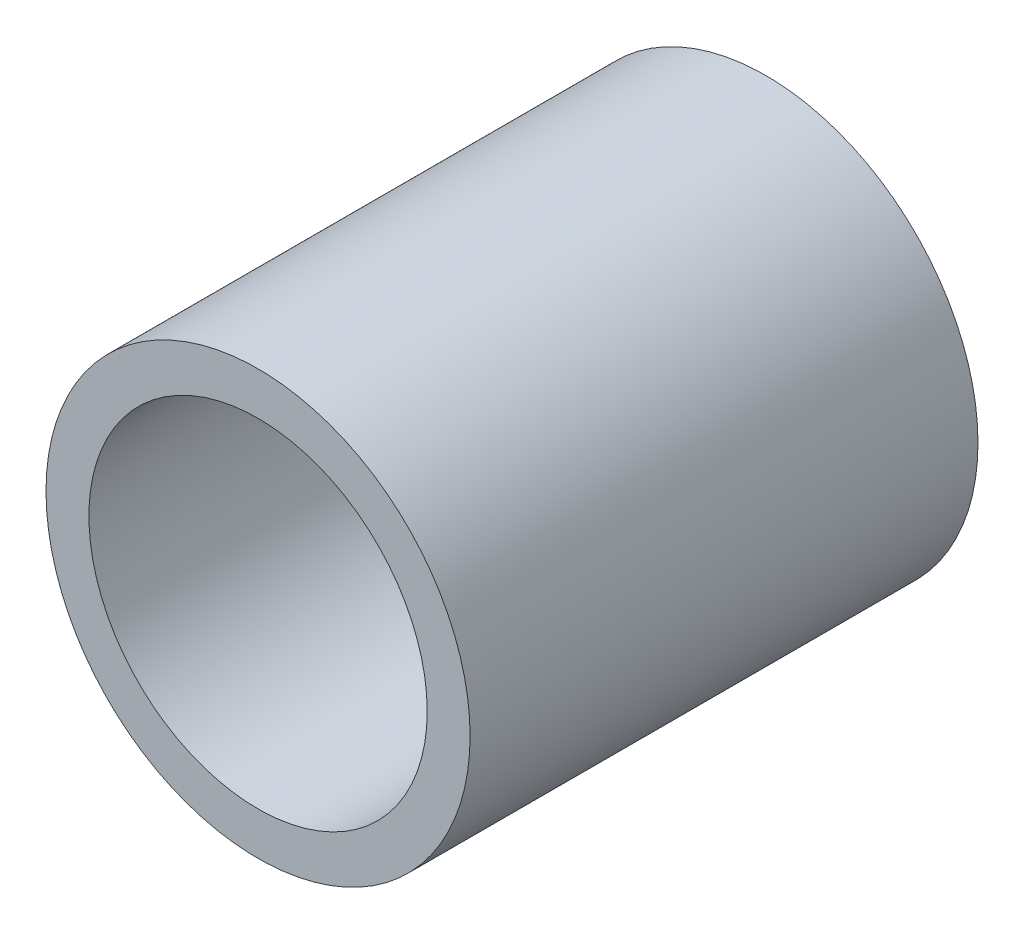
ISO-10303-21;
HEADER;
FILE_DESCRIPTION(('STEP AP214'),'2;1');
FILE_NAME('part.step','',(''),(''),'','','');
FILE_SCHEMA(('AUTOMOTIVE_DESIGN { 1 0 10303 214 1 1 1 1 }'));
ENDSEC;
DATA;
#1=APPLICATION_CONTEXT('core data for automotive mechanical design processes');
#2=APPLICATION_PROTOCOL_DEFINITION('international standard','automotive_design',2000,#1);
#3=PRODUCT_CONTEXT('',#1,'mechanical');
#4=PRODUCT('Part','Part','',(#3));
#5=PRODUCT_RELATED_PRODUCT_CATEGORY('part','',(#4));
#6=PRODUCT_DEFINITION_FORMATION('','',#4);
#7=PRODUCT_DEFINITION_CONTEXT('part definition',#1,'design');
#8=PRODUCT_DEFINITION('design','',#6,#7);
#9=PRODUCT_DEFINITION_SHAPE('','',#8);
#10=(LENGTH_UNIT() NAMED_UNIT(*) SI_UNIT(.MILLI.,.METRE.));
#11=(NAMED_UNIT(*) PLANE_ANGLE_UNIT() SI_UNIT($,.RADIAN.));
#12=(NAMED_UNIT(*) SI_UNIT($,.STERADIAN.) SOLID_ANGLE_UNIT());
#13=UNCERTAINTY_MEASURE_WITH_UNIT(LENGTH_MEASURE(1.E-05),#10,'distance_accuracy_value','');
#14=(GEOMETRIC_REPRESENTATION_CONTEXT(3) GLOBAL_UNCERTAINTY_ASSIGNED_CONTEXT((#13)) GLOBAL_UNIT_ASSIGNED_CONTEXT((#10,
#11,#12)) REPRESENTATION_CONTEXT('',''));
#15=CARTESIAN_POINT('',(0.,0.,0.));
#16=DIRECTION('',(0.,0.,1.));
#17=DIRECTION('',(1.,0.,0.));
#18=AXIS2_PLACEMENT_3D('',#15,#16,#17);
#19=CARTESIAN_POINT('',(0.,0.,20.));
#20=DIRECTION('',(0.,0.,1.));
#21=DIRECTION('',(1.,0.,0.));
#22=AXIS2_PLACEMENT_3D('',#19,#20,#21);
#23=PLANE('',#22);
#24=CARTESIAN_POINT('',(0.,0.,20.));
#25=DIRECTION('',(0.,0.,1.));
#26=DIRECTION('',(1.,0.,0.));
#27=AXIS2_PLACEMENT_3D('',#24,#25,#26);
#28=CIRCLE('',#27,16.7005);
#29=CARTESIAN_POINT('',(16.7005,0.,20.));
#30=VERTEX_POINT('',#29);
#31=EDGE_CURVE('E11',#30,#30,#28,.T.);
#32=ORIENTED_EDGE('',*,*,#31,.T.);
#33=EDGE_LOOP('',(#32));
#34=FACE_BOUND('',#33,.T.);
#35=CARTESIAN_POINT('',(0.,0.,20.));
#36=DIRECTION('',(0.,0.,1.));
#37=DIRECTION('',(1.,0.,0.));
#38=AXIS2_PLACEMENT_3D('',#35,#36,#37);
#39=CIRCLE('',#38,13.3223);
#40=CARTESIAN_POINT('',(13.3223,0.,20.));
#41=VERTEX_POINT('',#40);
#42=EDGE_CURVE('E48',#41,#41,#39,.T.);
#43=ORIENTED_EDGE('',*,*,#42,.F.);
#44=EDGE_LOOP('',(#43));
#45=FACE_BOUND('',#44,.T.);
#46=ADVANCED_FACE('F37',(#34,#45),#23,.T.);
#47=CARTESIAN_POINT('',(0.,0.,-20.));
#48=DIRECTION('',(0.,0.,1.));
#49=DIRECTION('',(1.,0.,0.));
#50=AXIS2_PLACEMENT_3D('',#47,#48,#49);
#51=PLANE('',#50);
#52=CARTESIAN_POINT('',(0.,0.,-20.));
#53=DIRECTION('',(0.,0.,1.));
#54=DIRECTION('',(1.,0.,0.));
#55=AXIS2_PLACEMENT_3D('',#52,#53,#54);
#56=CIRCLE('',#55,16.7005);
#57=CARTESIAN_POINT('',(16.7005,0.,-20.));
#58=VERTEX_POINT('',#57);
#59=EDGE_CURVE('E41',#58,#58,#56,.T.);
#60=ORIENTED_EDGE('',*,*,#59,.F.);
#61=EDGE_LOOP('',(#60));
#62=FACE_BOUND('',#61,.T.);
#63=CARTESIAN_POINT('',(0.,0.,-20.));
#64=DIRECTION('',(0.,0.,1.));
#65=DIRECTION('',(1.,0.,0.));
#66=AXIS2_PLACEMENT_3D('',#63,#64,#65);
#67=CIRCLE('',#66,13.3223);
#68=CARTESIAN_POINT('',(13.3223,0.,-20.));
#69=VERTEX_POINT('',#68);
#70=EDGE_CURVE('E50',#69,#69,#67,.T.);
#71=ORIENTED_EDGE('',*,*,#70,.T.);
#72=EDGE_LOOP('',(#71));
#73=FACE_BOUND('',#72,.T.);
#74=ADVANCED_FACE('F60',(#62,#73),#51,.F.);
#75=CARTESIAN_POINT('',(0.,0.,20.));
#76=DIRECTION('',(0.,0.,-1.));
#77=DIRECTION('',(-1.,0.,0.));
#78=AXIS2_PLACEMENT_3D('',#75,#76,#77);
#79=CYLINDRICAL_SURFACE('',#78,16.7005);
#80=ORIENTED_EDGE('',*,*,#31,.F.);
#81=EDGE_LOOP('',(#80));
#82=FACE_BOUND('',#81,.T.);
#83=ORIENTED_EDGE('',*,*,#59,.T.);
#84=EDGE_LOOP('',(#83));
#85=FACE_BOUND('',#84,.T.);
#86=ADVANCED_FACE('F39',(#82,#85),#79,.T.);
#87=CARTESIAN_POINT('',(0.,0.,20.));
#88=DIRECTION('',(0.,0.,-1.));
#89=DIRECTION('',(-1.,0.,0.));
#90=AXIS2_PLACEMENT_3D('',#87,#88,#89);
#91=CYLINDRICAL_SURFACE('',#90,13.3223);
#92=ORIENTED_EDGE('',*,*,#42,.T.);
#93=EDGE_LOOP('',(#92));
#94=FACE_BOUND('',#93,.T.);
#95=ORIENTED_EDGE('',*,*,#70,.F.);
#96=EDGE_LOOP('',(#95));
#97=FACE_BOUND('',#96,.T.);
#98=ADVANCED_FACE('F56',(#94,#97),#91,.F.);
#99=CLOSED_SHELL('',(#46,#74,#86,#98));
#100=MANIFOLD_SOLID_BREP('B2',#99);
#101=ADVANCED_BREP_SHAPE_REPRESENTATION('',(#18,#100),#14);
#102=SHAPE_DEFINITION_REPRESENTATION(#9,#101);
ENDSEC;
END-ISO-10303-21;
